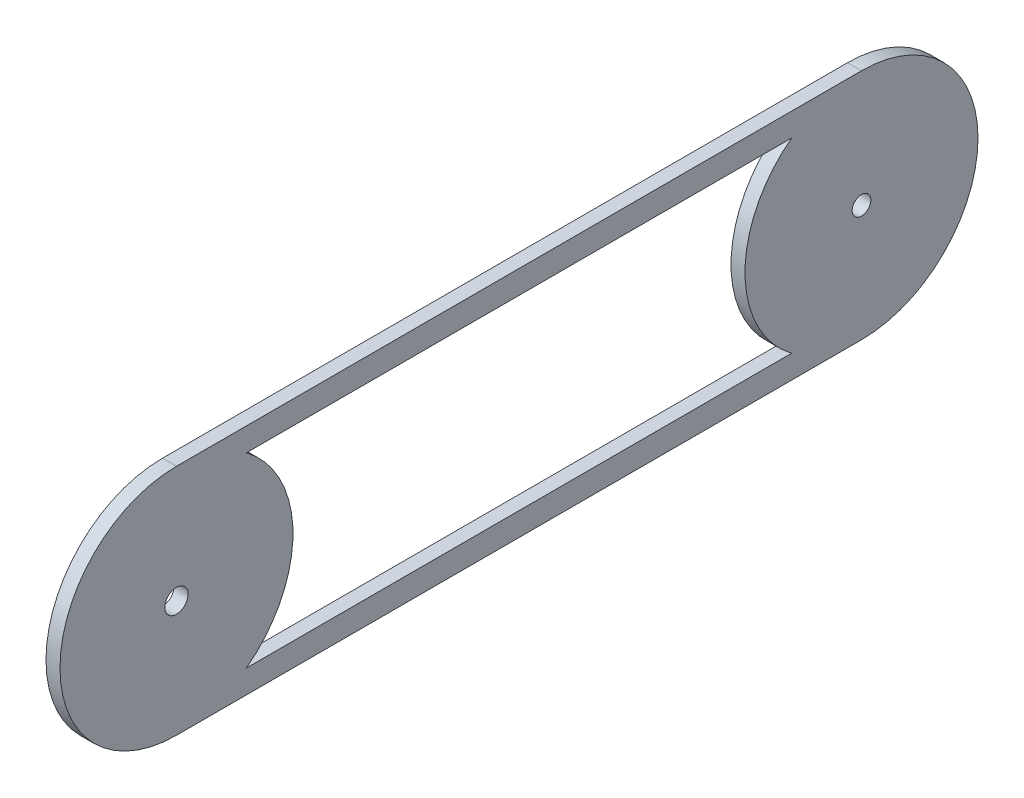
ISO-10303-21;
HEADER;
FILE_DESCRIPTION(('STEP AP214'),'2;1');
FILE_NAME('part.step','',(''),(''),'','','');
FILE_SCHEMA(('AUTOMOTIVE_DESIGN { 1 0 10303 214 1 1 1 1 }'));
ENDSEC;
DATA;
#1=APPLICATION_CONTEXT('core data for automotive mechanical design processes');
#2=APPLICATION_PROTOCOL_DEFINITION('international standard','automotive_design',2000,#1);
#3=PRODUCT_CONTEXT('',#1,'mechanical');
#4=PRODUCT('Part','Part','',(#3));
#5=PRODUCT_RELATED_PRODUCT_CATEGORY('part','',(#4));
#6=PRODUCT_DEFINITION_FORMATION('','',#4);
#7=PRODUCT_DEFINITION_CONTEXT('part definition',#1,'design');
#8=PRODUCT_DEFINITION('design','',#6,#7);
#9=PRODUCT_DEFINITION_SHAPE('','',#8);
#10=(LENGTH_UNIT() NAMED_UNIT(*) SI_UNIT(.MILLI.,.METRE.));
#11=(NAMED_UNIT(*) PLANE_ANGLE_UNIT() SI_UNIT($,.RADIAN.));
#12=(NAMED_UNIT(*) SI_UNIT($,.STERADIAN.) SOLID_ANGLE_UNIT());
#13=UNCERTAINTY_MEASURE_WITH_UNIT(LENGTH_MEASURE(1.E-05),#10,'distance_accuracy_value','');
#14=(GEOMETRIC_REPRESENTATION_CONTEXT(3) GLOBAL_UNCERTAINTY_ASSIGNED_CONTEXT((#13)) GLOBAL_UNIT_ASSIGNED_CONTEXT((#10,
#11,#12)) REPRESENTATION_CONTEXT('',''));
#15=CARTESIAN_POINT('',(0.,0.,0.));
#16=DIRECTION('',(0.,0.,1.));
#17=DIRECTION('',(1.,0.,0.));
#18=AXIS2_PLACEMENT_3D('',#15,#16,#17);
#19=CARTESIAN_POINT('',(3.,-25.,0.));
#20=DIRECTION('',(0.,-1.,0.));
#21=DIRECTION('',(0.,0.,-1.));
#22=AXIS2_PLACEMENT_3D('',#19,#20,#21);
#23=PLANE('',#22);
#24=DIRECTION('',(0.,0.,1.));
#25=VECTOR('',#24,1.);
#26=CARTESIAN_POINT('',(0.,-25.,0.));
#27=LINE('',#26,#25);
#28=CARTESIAN_POINT('',(0.,-25.,0.));
#29=VERTEX_POINT('',#28);
#30=CARTESIAN_POINT('',(0.,-25.,147.));
#31=VERTEX_POINT('',#30);
#32=EDGE_CURVE('E152',#29,#31,#27,.T.);
#33=ORIENTED_EDGE('',*,*,#32,.F.);
#34=DIRECTION('',(-1.,0.,0.));
#35=VECTOR('',#34,1.);
#36=CARTESIAN_POINT('',(3.,-25.,0.));
#37=LINE('',#36,#35);
#38=CARTESIAN_POINT('',(3.,-25.,0.));
#39=VERTEX_POINT('',#38);
#40=EDGE_CURVE('E11',#39,#29,#37,.T.);
#41=ORIENTED_EDGE('',*,*,#40,.F.);
#42=DIRECTION('',(0.,0.,1.));
#43=VECTOR('',#42,1.);
#44=CARTESIAN_POINT('',(3.,-25.,0.));
#45=LINE('',#44,#43);
#46=CARTESIAN_POINT('',(3.,-25.,147.));
#47=VERTEX_POINT('',#46);
#48=EDGE_CURVE('E128',#39,#47,#45,.T.);
#49=ORIENTED_EDGE('',*,*,#48,.T.);
#50=DIRECTION('',(-1.,0.,0.));
#51=VECTOR('',#50,1.);
#52=CARTESIAN_POINT('',(3.,-25.,147.));
#53=LINE('',#52,#51);
#54=EDGE_CURVE('E89',#47,#31,#53,.T.);
#55=ORIENTED_EDGE('',*,*,#54,.T.);
#56=EDGE_LOOP('',(#33,#41,#49,#55));
#57=FACE_BOUND('',#56,.T.);
#58=ADVANCED_FACE('F35',(#57),#23,.T.);
#59=CARTESIAN_POINT('',(3.,0.,0.));
#60=DIRECTION('',(-1.,0.,0.));
#61=DIRECTION('',(0.,0.,1.));
#62=AXIS2_PLACEMENT_3D('',#59,#60,#61);
#63=CYLINDRICAL_SURFACE('',#62,25.);
#64=CARTESIAN_POINT('',(0.,0.,0.));
#65=DIRECTION('',(1.,0.,0.));
#66=DIRECTION('',(0.,0.,-1.));
#67=AXIS2_PLACEMENT_3D('',#64,#65,#66);
#68=CIRCLE('',#67,25.);
#69=CARTESIAN_POINT('',(0.,25.,0.));
#70=VERTEX_POINT('',#69);
#71=EDGE_CURVE('E117',#70,#29,#68,.F.);
#72=ORIENTED_EDGE('',*,*,#71,.F.);
#73=DIRECTION('',(-1.,0.,0.));
#74=VECTOR('',#73,1.);
#75=CARTESIAN_POINT('',(3.,25.,0.));
#76=LINE('',#75,#74);
#77=CARTESIAN_POINT('',(3.,25.,0.));
#78=VERTEX_POINT('',#77);
#79=EDGE_CURVE('E45',#78,#70,#76,.T.);
#80=ORIENTED_EDGE('',*,*,#79,.F.);
#81=CARTESIAN_POINT('',(3.,0.,0.));
#82=DIRECTION('',(1.,0.,0.));
#83=DIRECTION('',(0.,0.,-1.));
#84=AXIS2_PLACEMENT_3D('',#81,#82,#83);
#85=CIRCLE('',#84,25.);
#86=EDGE_CURVE('E115',#78,#39,#85,.F.);
#87=ORIENTED_EDGE('',*,*,#86,.T.);
#88=ORIENTED_EDGE('',*,*,#40,.T.);
#89=EDGE_LOOP('',(#72,#80,#87,#88));
#90=FACE_BOUND('',#89,.T.);
#91=ADVANCED_FACE('F113',(#90),#63,.T.);
#92=CARTESIAN_POINT('',(3.,25.,0.));
#93=DIRECTION('',(0.,-1.,0.));
#94=DIRECTION('',(0.,0.,-1.));
#95=AXIS2_PLACEMENT_3D('',#92,#93,#94);
#96=PLANE('',#95);
#97=DIRECTION('',(0.,0.,1.));
#98=VECTOR('',#97,1.);
#99=CARTESIAN_POINT('',(0.,25.,0.));
#100=LINE('',#99,#98);
#101=CARTESIAN_POINT('',(0.,25.,147.));
#102=VERTEX_POINT('',#101);
#103=EDGE_CURVE('E155',#70,#102,#100,.T.);
#104=ORIENTED_EDGE('',*,*,#103,.T.);
#105=DIRECTION('',(-1.,0.,0.));
#106=VECTOR('',#105,1.);
#107=CARTESIAN_POINT('',(3.,25.,147.));
#108=LINE('',#107,#106);
#109=CARTESIAN_POINT('',(3.,25.,147.));
#110=VERTEX_POINT('',#109);
#111=EDGE_CURVE('E120',#110,#102,#108,.T.);
#112=ORIENTED_EDGE('',*,*,#111,.F.);
#113=DIRECTION('',(0.,0.,1.));
#114=VECTOR('',#113,1.);
#115=CARTESIAN_POINT('',(3.,25.,0.));
#116=LINE('',#115,#114);
#117=EDGE_CURVE('E123',#78,#110,#116,.T.);
#118=ORIENTED_EDGE('',*,*,#117,.F.);
#119=ORIENTED_EDGE('',*,*,#79,.T.);
#120=EDGE_LOOP('',(#104,#112,#118,#119));
#121=FACE_BOUND('',#120,.T.);
#122=ADVANCED_FACE('F124',(#121),#96,.F.);
#123=CARTESIAN_POINT('',(3.,20.,0.));
#124=DIRECTION('',(0.,-1.,0.));
#125=DIRECTION('',(0.,0.,-1.));
#126=AXIS2_PLACEMENT_3D('',#123,#124,#125);
#127=PLANE('',#126);
#128=DIRECTION('',(0.,0.,1.));
#129=VECTOR('',#128,1.);
#130=CARTESIAN_POINT('',(0.,20.,0.));
#131=LINE('',#130,#129);
#132=CARTESIAN_POINT('',(0.,20.,15.));
#133=VERTEX_POINT('',#132);
#134=CARTESIAN_POINT('',(0.,20.,132.));
#135=VERTEX_POINT('',#134);
#136=EDGE_CURVE('E142',#133,#135,#131,.T.);
#137=ORIENTED_EDGE('',*,*,#136,.F.);
#138=DIRECTION('',(-1.,0.,0.));
#139=VECTOR('',#138,1.);
#140=CARTESIAN_POINT('',(3.,20.,15.));
#141=LINE('',#140,#139);
#142=CARTESIAN_POINT('',(3.,20.,15.));
#143=VERTEX_POINT('',#142);
#144=EDGE_CURVE('E39',#143,#133,#141,.T.);
#145=ORIENTED_EDGE('',*,*,#144,.F.);
#146=DIRECTION('',(0.,0.,1.));
#147=VECTOR('',#146,1.);
#148=CARTESIAN_POINT('',(3.,20.,0.));
#149=LINE('',#148,#147);
#150=CARTESIAN_POINT('',(3.,20.,132.));
#151=VERTEX_POINT('',#150);
#152=EDGE_CURVE('E164',#143,#151,#149,.T.);
#153=ORIENTED_EDGE('',*,*,#152,.T.);
#154=DIRECTION('',(-1.,0.,0.));
#155=VECTOR('',#154,1.);
#156=CARTESIAN_POINT('',(3.,20.,132.));
#157=LINE('',#156,#155);
#158=EDGE_CURVE('E141',#151,#135,#157,.T.);
#159=ORIENTED_EDGE('',*,*,#158,.T.);
#160=EDGE_LOOP('',(#137,#145,#153,#159));
#161=FACE_BOUND('',#160,.T.);
#162=ADVANCED_FACE('F37',(#161),#127,.T.);
#163=CARTESIAN_POINT('',(3.,0.,0.));
#164=DIRECTION('',(-1.,0.,0.));
#165=DIRECTION('',(0.,0.,1.));
#166=AXIS2_PLACEMENT_3D('',#163,#164,#165);
#167=CYLINDRICAL_SURFACE('',#166,25.);
#168=CARTESIAN_POINT('',(0.,0.,0.));
#169=DIRECTION('',(1.,0.,0.));
#170=DIRECTION('',(0.,0.,-1.));
#171=AXIS2_PLACEMENT_3D('',#168,#169,#170);
#172=CIRCLE('',#171,25.);
#173=CARTESIAN_POINT('',(0.,-20.,15.));
#174=VERTEX_POINT('',#173);
#175=EDGE_CURVE('E145',#133,#174,#172,.T.);
#176=ORIENTED_EDGE('',*,*,#175,.T.);
#177=DIRECTION('',(-1.,0.,0.));
#178=VECTOR('',#177,1.);
#179=CARTESIAN_POINT('',(3.,-20.,15.));
#180=LINE('',#179,#178);
#181=CARTESIAN_POINT('',(3.,-20.,15.));
#182=VERTEX_POINT('',#181);
#183=EDGE_CURVE('E170',#182,#174,#180,.T.);
#184=ORIENTED_EDGE('',*,*,#183,.F.);
#185=CARTESIAN_POINT('',(3.,0.,0.));
#186=DIRECTION('',(1.,0.,0.));
#187=DIRECTION('',(0.,0.,-1.));
#188=AXIS2_PLACEMENT_3D('',#185,#186,#187);
#189=CIRCLE('',#188,25.);
#190=EDGE_CURVE('E179',#143,#182,#189,.T.);
#191=ORIENTED_EDGE('',*,*,#190,.F.);
#192=ORIENTED_EDGE('',*,*,#144,.T.);
#193=EDGE_LOOP('',(#176,#184,#191,#192));
#194=FACE_BOUND('',#193,.T.);
#195=ADVANCED_FACE('F178',(#194),#167,.T.);
#196=CARTESIAN_POINT('',(3.,-20.,0.));
#197=DIRECTION('',(0.,-1.,0.));
#198=DIRECTION('',(0.,0.,-1.));
#199=AXIS2_PLACEMENT_3D('',#196,#197,#198);
#200=PLANE('',#199);
#201=DIRECTION('',(0.,0.,1.));
#202=VECTOR('',#201,1.);
#203=CARTESIAN_POINT('',(0.,-20.,0.));
#204=LINE('',#203,#202);
#205=CARTESIAN_POINT('',(0.,-20.,132.));
#206=VERTEX_POINT('',#205);
#207=EDGE_CURVE('E147',#174,#206,#204,.T.);
#208=ORIENTED_EDGE('',*,*,#207,.T.);
#209=DIRECTION('',(-1.,0.,0.));
#210=VECTOR('',#209,1.);
#211=CARTESIAN_POINT('',(3.,-20.,132.));
#212=LINE('',#211,#210);
#213=CARTESIAN_POINT('',(3.,-20.,132.));
#214=VERTEX_POINT('',#213);
#215=EDGE_CURVE('E168',#214,#206,#212,.T.);
#216=ORIENTED_EDGE('',*,*,#215,.F.);
#217=DIRECTION('',(0.,0.,1.));
#218=VECTOR('',#217,1.);
#219=CARTESIAN_POINT('',(3.,-20.,0.));
#220=LINE('',#219,#218);
#221=EDGE_CURVE('E190',#182,#214,#220,.T.);
#222=ORIENTED_EDGE('',*,*,#221,.F.);
#223=ORIENTED_EDGE('',*,*,#183,.T.);
#224=EDGE_LOOP('',(#208,#216,#222,#223));
#225=FACE_BOUND('',#224,.T.);
#226=ADVANCED_FACE('F189',(#225),#200,.F.);
#227=CARTESIAN_POINT('',(3.,0.,147.));
#228=DIRECTION('',(-1.,0.,0.));
#229=DIRECTION('',(0.,0.,1.));
#230=AXIS2_PLACEMENT_3D('',#227,#228,#229);
#231=CYLINDRICAL_SURFACE('',#230,2.5);
#232=CARTESIAN_POINT('',(3.,0.,147.));
#233=DIRECTION('',(1.,0.,0.));
#234=DIRECTION('',(0.,0.,-1.));
#235=AXIS2_PLACEMENT_3D('',#232,#233,#234);
#236=CIRCLE('',#235,2.5);
#237=CARTESIAN_POINT('',(3.,0.,144.5));
#238=VERTEX_POINT('',#237);
#239=EDGE_CURVE('E135',#238,#238,#236,.T.);
#240=ORIENTED_EDGE('',*,*,#239,.T.);
#241=EDGE_LOOP('',(#240));
#242=FACE_BOUND('',#241,.T.);
#243=CARTESIAN_POINT('',(0.,0.,147.));
#244=DIRECTION('',(1.,0.,0.));
#245=DIRECTION('',(0.,0.,-1.));
#246=AXIS2_PLACEMENT_3D('',#243,#244,#245);
#247=CIRCLE('',#246,2.5);
#248=CARTESIAN_POINT('',(0.,0.,144.5));
#249=VERTEX_POINT('',#248);
#250=EDGE_CURVE('E158',#249,#249,#247,.T.);
#251=ORIENTED_EDGE('',*,*,#250,.F.);
#252=EDGE_LOOP('',(#251));
#253=FACE_BOUND('',#252,.T.);
#254=ADVANCED_FACE('F217',(#242,#253),#231,.F.);
#255=CARTESIAN_POINT('',(3.,0.,147.));
#256=DIRECTION('',(-1.,0.,0.));
#257=DIRECTION('',(0.,0.,1.));
#258=AXIS2_PLACEMENT_3D('',#255,#256,#257);
#259=CYLINDRICAL_SURFACE('',#258,25.);
#260=CARTESIAN_POINT('',(0.,0.,147.));
#261=DIRECTION('',(1.,0.,0.));
#262=DIRECTION('',(0.,0.,-1.));
#263=AXIS2_PLACEMENT_3D('',#260,#261,#262);
#264=CIRCLE('',#263,25.);
#265=EDGE_CURVE('E82',#102,#31,#264,.T.);
#266=ORIENTED_EDGE('',*,*,#265,.T.);
#267=ORIENTED_EDGE('',*,*,#54,.F.);
#268=CARTESIAN_POINT('',(3.,0.,147.));
#269=DIRECTION('',(1.,0.,0.));
#270=DIRECTION('',(0.,0.,-1.));
#271=AXIS2_PLACEMENT_3D('',#268,#269,#270);
#272=CIRCLE('',#271,25.);
#273=EDGE_CURVE('E54',#110,#47,#272,.T.);
#274=ORIENTED_EDGE('',*,*,#273,.F.);
#275=ORIENTED_EDGE('',*,*,#111,.T.);
#276=EDGE_LOOP('',(#266,#267,#274,#275));
#277=FACE_BOUND('',#276,.T.);
#278=ADVANCED_FACE('F215',(#277),#259,.T.);
#279=CARTESIAN_POINT('',(3.,0.,147.));
#280=DIRECTION('',(-1.,0.,0.));
#281=DIRECTION('',(0.,0.,1.));
#282=AXIS2_PLACEMENT_3D('',#279,#280,#281);
#283=CYLINDRICAL_SURFACE('',#282,25.);
#284=CARTESIAN_POINT('',(0.,0.,147.));
#285=DIRECTION('',(1.,0.,0.));
#286=DIRECTION('',(0.,0.,-1.));
#287=AXIS2_PLACEMENT_3D('',#284,#285,#286);
#288=CIRCLE('',#287,25.);
#289=EDGE_CURVE('E149',#206,#135,#288,.T.);
#290=ORIENTED_EDGE('',*,*,#289,.T.);
#291=ORIENTED_EDGE('',*,*,#158,.F.);
#292=CARTESIAN_POINT('',(3.,0.,147.));
#293=DIRECTION('',(1.,0.,0.));
#294=DIRECTION('',(0.,0.,-1.));
#295=AXIS2_PLACEMENT_3D('',#292,#293,#294);
#296=CIRCLE('',#295,25.);
#297=EDGE_CURVE('E130',#214,#151,#296,.T.);
#298=ORIENTED_EDGE('',*,*,#297,.F.);
#299=ORIENTED_EDGE('',*,*,#215,.T.);
#300=EDGE_LOOP('',(#290,#291,#298,#299));
#301=FACE_BOUND('',#300,.T.);
#302=ADVANCED_FACE('F187',(#301),#283,.T.);
#303=CARTESIAN_POINT('',(3.,0.,0.));
#304=DIRECTION('',(-1.,0.,0.));
#305=DIRECTION('',(0.,0.,1.));
#306=AXIS2_PLACEMENT_3D('',#303,#304,#305);
#307=CYLINDRICAL_SURFACE('',#306,2.);
#308=CARTESIAN_POINT('',(3.,0.,0.));
#309=DIRECTION('',(1.,0.,0.));
#310=DIRECTION('',(0.,0.,-1.));
#311=AXIS2_PLACEMENT_3D('',#308,#309,#310);
#312=CIRCLE('',#311,2.);
#313=CARTESIAN_POINT('',(3.,0.,-2.));
#314=VERTEX_POINT('',#313);
#315=EDGE_CURVE('E138',#314,#314,#312,.T.);
#316=ORIENTED_EDGE('',*,*,#315,.T.);
#317=EDGE_LOOP('',(#316));
#318=FACE_BOUND('',#317,.T.);
#319=CARTESIAN_POINT('',(0.,0.,0.));
#320=DIRECTION('',(1.,0.,0.));
#321=DIRECTION('',(0.,0.,-1.));
#322=AXIS2_PLACEMENT_3D('',#319,#320,#321);
#323=CIRCLE('',#322,2.);
#324=CARTESIAN_POINT('',(0.,0.,-2.));
#325=VERTEX_POINT('',#324);
#326=EDGE_CURVE('E161',#325,#325,#323,.T.);
#327=ORIENTED_EDGE('',*,*,#326,.F.);
#328=EDGE_LOOP('',(#327));
#329=FACE_BOUND('',#328,.T.);
#330=ADVANCED_FACE('F196',(#318,#329),#307,.F.);
#331=CARTESIAN_POINT('',(3.,0.,0.));
#332=DIRECTION('',(1.,0.,0.));
#333=DIRECTION('',(0.,0.,-1.));
#334=AXIS2_PLACEMENT_3D('',#331,#332,#333);
#335=PLANE('',#334);
#336=ORIENTED_EDGE('',*,*,#152,.F.);
#337=ORIENTED_EDGE('',*,*,#190,.T.);
#338=ORIENTED_EDGE('',*,*,#221,.T.);
#339=ORIENTED_EDGE('',*,*,#297,.T.);
#340=EDGE_LOOP('',(#336,#337,#338,#339));
#341=FACE_BOUND('',#340,.T.);
#342=ORIENTED_EDGE('',*,*,#48,.F.);
#343=ORIENTED_EDGE('',*,*,#86,.F.);
#344=ORIENTED_EDGE('',*,*,#117,.T.);
#345=ORIENTED_EDGE('',*,*,#273,.T.);
#346=EDGE_LOOP('',(#342,#343,#344,#345));
#347=FACE_BOUND('',#346,.T.);
#348=ORIENTED_EDGE('',*,*,#239,.F.);
#349=EDGE_LOOP('',(#348));
#350=FACE_BOUND('',#349,.T.);
#351=ORIENTED_EDGE('',*,*,#315,.F.);
#352=EDGE_LOOP('',(#351));
#353=FACE_BOUND('',#352,.T.);
#354=ADVANCED_FACE('F126',(#341,#347,#350,#353),#335,.T.);
#355=CARTESIAN_POINT('',(0.,0.,0.));
#356=DIRECTION('',(1.,0.,0.));
#357=DIRECTION('',(0.,0.,-1.));
#358=AXIS2_PLACEMENT_3D('',#355,#356,#357);
#359=PLANE('',#358);
#360=ORIENTED_EDGE('',*,*,#136,.T.);
#361=ORIENTED_EDGE('',*,*,#289,.F.);
#362=ORIENTED_EDGE('',*,*,#207,.F.);
#363=ORIENTED_EDGE('',*,*,#175,.F.);
#364=EDGE_LOOP('',(#360,#361,#362,#363));
#365=FACE_BOUND('',#364,.T.);
#366=ORIENTED_EDGE('',*,*,#32,.T.);
#367=ORIENTED_EDGE('',*,*,#265,.F.);
#368=ORIENTED_EDGE('',*,*,#103,.F.);
#369=ORIENTED_EDGE('',*,*,#71,.T.);
#370=EDGE_LOOP('',(#366,#367,#368,#369));
#371=FACE_BOUND('',#370,.T.);
#372=ORIENTED_EDGE('',*,*,#250,.T.);
#373=EDGE_LOOP('',(#372));
#374=FACE_BOUND('',#373,.T.);
#375=ORIENTED_EDGE('',*,*,#326,.T.);
#376=EDGE_LOOP('',(#375));
#377=FACE_BOUND('',#376,.T.);
#378=ADVANCED_FACE('F182',(#365,#371,#374,#377),#359,.F.);
#379=CLOSED_SHELL('',(#58,#91,#122,#162,#195,#226,#254,#278,#302,#330,#354,#378));
#380=MANIFOLD_SOLID_BREP('B2',#379);
#381=ADVANCED_BREP_SHAPE_REPRESENTATION('',(#18,#380),#14);
#382=SHAPE_DEFINITION_REPRESENTATION(#9,#381);
ENDSEC;
END-ISO-10303-21;
